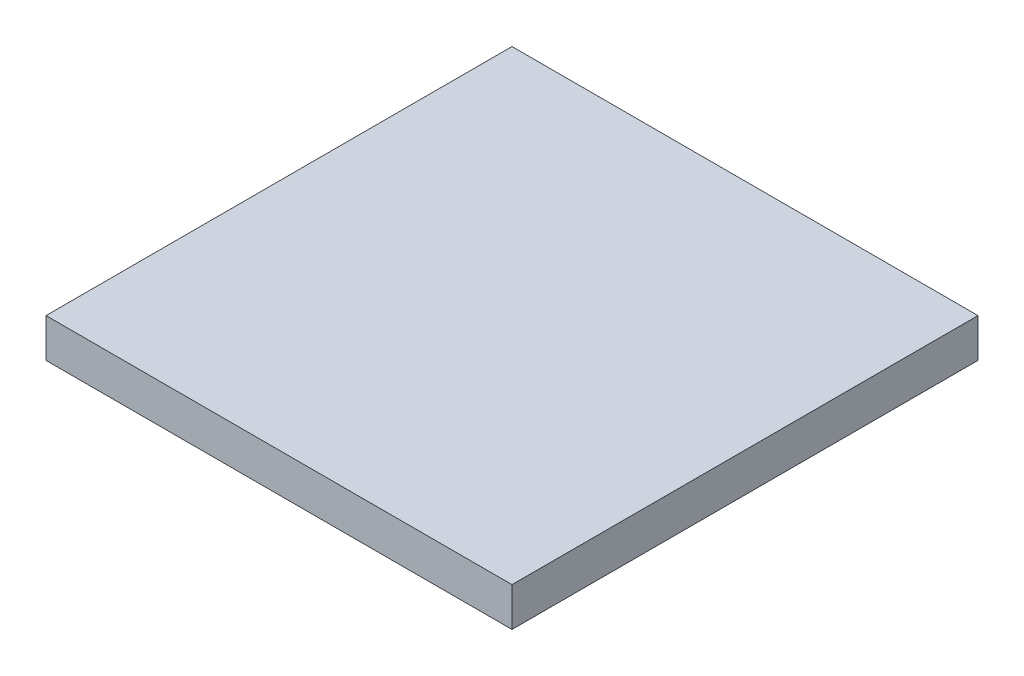
ISO-10303-21;
HEADER;
FILE_DESCRIPTION(('STEP AP214'),'2;1');
FILE_NAME('part.step','',(''),(''),'','','');
FILE_SCHEMA(('AUTOMOTIVE_DESIGN { 1 0 10303 214 1 1 1 1 }'));
ENDSEC;
DATA;
#1=APPLICATION_CONTEXT('core data for automotive mechanical design processes');
#2=APPLICATION_PROTOCOL_DEFINITION('international standard','automotive_design',2000,#1);
#3=PRODUCT_CONTEXT('',#1,'mechanical');
#4=PRODUCT('Part','Part','',(#3));
#5=PRODUCT_RELATED_PRODUCT_CATEGORY('part','',(#4));
#6=PRODUCT_DEFINITION_FORMATION('','',#4);
#7=PRODUCT_DEFINITION_CONTEXT('part definition',#1,'design');
#8=PRODUCT_DEFINITION('design','',#6,#7);
#9=PRODUCT_DEFINITION_SHAPE('','',#8);
#10=(LENGTH_UNIT() NAMED_UNIT(*) SI_UNIT(.MILLI.,.METRE.));
#11=(NAMED_UNIT(*) PLANE_ANGLE_UNIT() SI_UNIT($,.RADIAN.));
#12=(NAMED_UNIT(*) SI_UNIT($,.STERADIAN.) SOLID_ANGLE_UNIT());
#13=UNCERTAINTY_MEASURE_WITH_UNIT(LENGTH_MEASURE(1.E-05),#10,'distance_accuracy_value','');
#14=(GEOMETRIC_REPRESENTATION_CONTEXT(3) GLOBAL_UNCERTAINTY_ASSIGNED_CONTEXT((#13)) GLOBAL_UNIT_ASSIGNED_CONTEXT((#10,
#11,#12)) REPRESENTATION_CONTEXT('',''));
#15=CARTESIAN_POINT('',(0.,0.,0.));
#16=DIRECTION('',(0.,0.,1.));
#17=DIRECTION('',(1.,0.,0.));
#18=AXIS2_PLACEMENT_3D('',#15,#16,#17);
#19=CARTESIAN_POINT('',(0.,0.,0.));
#20=DIRECTION('',(0.,1.,0.));
#21=DIRECTION('',(0.,0.,1.));
#22=AXIS2_PLACEMENT_3D('',#19,#20,#21);
#23=PLANE('',#22);
#24=DIRECTION('',(0.,0.,-1.));
#25=VECTOR('',#24,1.);
#26=CARTESIAN_POINT('',(6.,0.,6.));
#27=LINE('',#26,#25);
#28=CARTESIAN_POINT('',(6.,0.,6.));
#29=VERTEX_POINT('',#28);
#30=CARTESIAN_POINT('',(6.,0.,-6.));
#31=VERTEX_POINT('',#30);
#32=EDGE_CURVE('E56',#29,#31,#27,.T.);
#33=ORIENTED_EDGE('',*,*,#32,.F.);
#34=DIRECTION('',(1.,0.,0.));
#35=VECTOR('',#34,1.);
#36=CARTESIAN_POINT('',(-6.,0.,6.));
#37=LINE('',#36,#35);
#38=CARTESIAN_POINT('',(-6.,0.,6.));
#39=VERTEX_POINT('',#38);
#40=EDGE_CURVE('E19',#39,#29,#37,.T.);
#41=ORIENTED_EDGE('',*,*,#40,.F.);
#42=DIRECTION('',(0.,0.,1.));
#43=VECTOR('',#42,1.);
#44=CARTESIAN_POINT('',(-6.,0.,-6.));
#45=LINE('',#44,#43);
#46=CARTESIAN_POINT('',(-6.,0.,-6.));
#47=VERTEX_POINT('',#46);
#48=EDGE_CURVE('E78',#47,#39,#45,.T.);
#49=ORIENTED_EDGE('',*,*,#48,.F.);
#50=DIRECTION('',(-1.,0.,0.));
#51=VECTOR('',#50,1.);
#52=CARTESIAN_POINT('',(6.,0.,-6.));
#53=LINE('',#52,#51);
#54=EDGE_CURVE('E54',#31,#47,#53,.T.);
#55=ORIENTED_EDGE('',*,*,#54,.F.);
#56=EDGE_LOOP('',(#33,#41,#49,#55));
#57=FACE_BOUND('',#56,.T.);
#58=ADVANCED_FACE('F16',(#57),#23,.F.);
#59=CARTESIAN_POINT('',(-6.,0.,6.));
#60=DIRECTION('',(0.,0.,1.));
#61=DIRECTION('',(1.,0.,0.));
#62=AXIS2_PLACEMENT_3D('',#59,#60,#61);
#63=PLANE('',#62);
#64=DIRECTION('',(1.,0.,0.));
#65=VECTOR('',#64,1.);
#66=CARTESIAN_POINT('',(0.,1.,6.));
#67=LINE('',#66,#65);
#68=CARTESIAN_POINT('',(-6.,1.,6.));
#69=VERTEX_POINT('',#68);
#70=CARTESIAN_POINT('',(6.,1.,6.));
#71=VERTEX_POINT('',#70);
#72=EDGE_CURVE('E82',#69,#71,#67,.T.);
#73=ORIENTED_EDGE('',*,*,#72,.F.);
#74=DIRECTION('',(0.,1.,0.));
#75=VECTOR('',#74,1.);
#76=CARTESIAN_POINT('',(-6.,0.,6.));
#77=LINE('',#76,#75);
#78=EDGE_CURVE('E67',#39,#69,#77,.T.);
#79=ORIENTED_EDGE('',*,*,#78,.F.);
#80=ORIENTED_EDGE('',*,*,#40,.T.);
#81=DIRECTION('',(0.,1.,0.));
#82=VECTOR('',#81,1.);
#83=CARTESIAN_POINT('',(6.,0.,6.));
#84=LINE('',#83,#82);
#85=EDGE_CURVE('E62',#71,#29,#84,.F.);
#86=ORIENTED_EDGE('',*,*,#85,.F.);
#87=EDGE_LOOP('',(#73,#79,#80,#86));
#88=FACE_BOUND('',#87,.T.);
#89=ADVANCED_FACE('F64',(#88),#63,.T.);
#90=CARTESIAN_POINT('',(6.,0.,6.));
#91=DIRECTION('',(1.,0.,0.));
#92=DIRECTION('',(0.,0.,-1.));
#93=AXIS2_PLACEMENT_3D('',#90,#91,#92);
#94=PLANE('',#93);
#95=DIRECTION('',(0.,0.,1.));
#96=VECTOR('',#95,1.);
#97=CARTESIAN_POINT('',(6.,1.,0.));
#98=LINE('',#97,#96);
#99=CARTESIAN_POINT('',(6.,1.,-6.));
#100=VERTEX_POINT('',#99);
#101=EDGE_CURVE('E71',#71,#100,#98,.F.);
#102=ORIENTED_EDGE('',*,*,#101,.F.);
#103=ORIENTED_EDGE('',*,*,#85,.T.);
#104=ORIENTED_EDGE('',*,*,#32,.T.);
#105=DIRECTION('',(0.,1.,0.));
#106=VECTOR('',#105,1.);
#107=CARTESIAN_POINT('',(6.,0.,-6.));
#108=LINE('',#107,#106);
#109=EDGE_CURVE('E74',#100,#31,#108,.F.);
#110=ORIENTED_EDGE('',*,*,#109,.F.);
#111=EDGE_LOOP('',(#102,#103,#104,#110));
#112=FACE_BOUND('',#111,.T.);
#113=ADVANCED_FACE('F69',(#112),#94,.T.);
#114=CARTESIAN_POINT('',(6.,0.,-6.));
#115=DIRECTION('',(0.,0.,-1.));
#116=DIRECTION('',(-1.,0.,0.));
#117=AXIS2_PLACEMENT_3D('',#114,#115,#116);
#118=PLANE('',#117);
#119=DIRECTION('',(1.,0.,0.));
#120=VECTOR('',#119,1.);
#121=CARTESIAN_POINT('',(0.,1.,-6.));
#122=LINE('',#121,#120);
#123=CARTESIAN_POINT('',(-6.,1.,-6.));
#124=VERTEX_POINT('',#123);
#125=EDGE_CURVE('E25',#100,#124,#122,.F.);
#126=ORIENTED_EDGE('',*,*,#125,.F.);
#127=ORIENTED_EDGE('',*,*,#109,.T.);
#128=ORIENTED_EDGE('',*,*,#54,.T.);
#129=DIRECTION('',(0.,1.,0.));
#130=VECTOR('',#129,1.);
#131=CARTESIAN_POINT('',(-6.,0.,-6.));
#132=LINE('',#131,#130);
#133=EDGE_CURVE('E34',#124,#47,#132,.F.);
#134=ORIENTED_EDGE('',*,*,#133,.F.);
#135=EDGE_LOOP('',(#126,#127,#128,#134));
#136=FACE_BOUND('',#135,.T.);
#137=ADVANCED_FACE('F88',(#136),#118,.T.);
#138=CARTESIAN_POINT('',(-6.,0.,-6.));
#139=DIRECTION('',(-1.,0.,0.));
#140=DIRECTION('',(0.,0.,1.));
#141=AXIS2_PLACEMENT_3D('',#138,#139,#140);
#142=PLANE('',#141);
#143=DIRECTION('',(0.,0.,1.));
#144=VECTOR('',#143,1.);
#145=CARTESIAN_POINT('',(-6.,1.,0.));
#146=LINE('',#145,#144);
#147=EDGE_CURVE('E11',#124,#69,#146,.T.);
#148=ORIENTED_EDGE('',*,*,#147,.F.);
#149=ORIENTED_EDGE('',*,*,#133,.T.);
#150=ORIENTED_EDGE('',*,*,#48,.T.);
#151=ORIENTED_EDGE('',*,*,#78,.T.);
#152=EDGE_LOOP('',(#148,#149,#150,#151));
#153=FACE_BOUND('',#152,.T.);
#154=ADVANCED_FACE('F90',(#153),#142,.T.);
#155=CARTESIAN_POINT('',(0.,1.,0.));
#156=DIRECTION('',(0.,1.,0.));
#157=DIRECTION('',(0.,0.,1.));
#158=AXIS2_PLACEMENT_3D('',#155,#156,#157);
#159=PLANE('',#158);
#160=ORIENTED_EDGE('',*,*,#125,.T.);
#161=ORIENTED_EDGE('',*,*,#147,.T.);
#162=ORIENTED_EDGE('',*,*,#72,.T.);
#163=ORIENTED_EDGE('',*,*,#101,.T.);
#164=EDGE_LOOP('',(#160,#161,#162,#163));
#165=FACE_BOUND('',#164,.T.);
#166=ADVANCED_FACE('F87',(#165),#159,.T.);
#167=CLOSED_SHELL('',(#58,#89,#113,#137,#154,#166));
#168=MANIFOLD_SOLID_BREP('B1',#167);
#169=ADVANCED_BREP_SHAPE_REPRESENTATION('',(#18,#168),#14);
#170=SHAPE_DEFINITION_REPRESENTATION(#9,#169);
ENDSEC;
END-ISO-10303-21;
